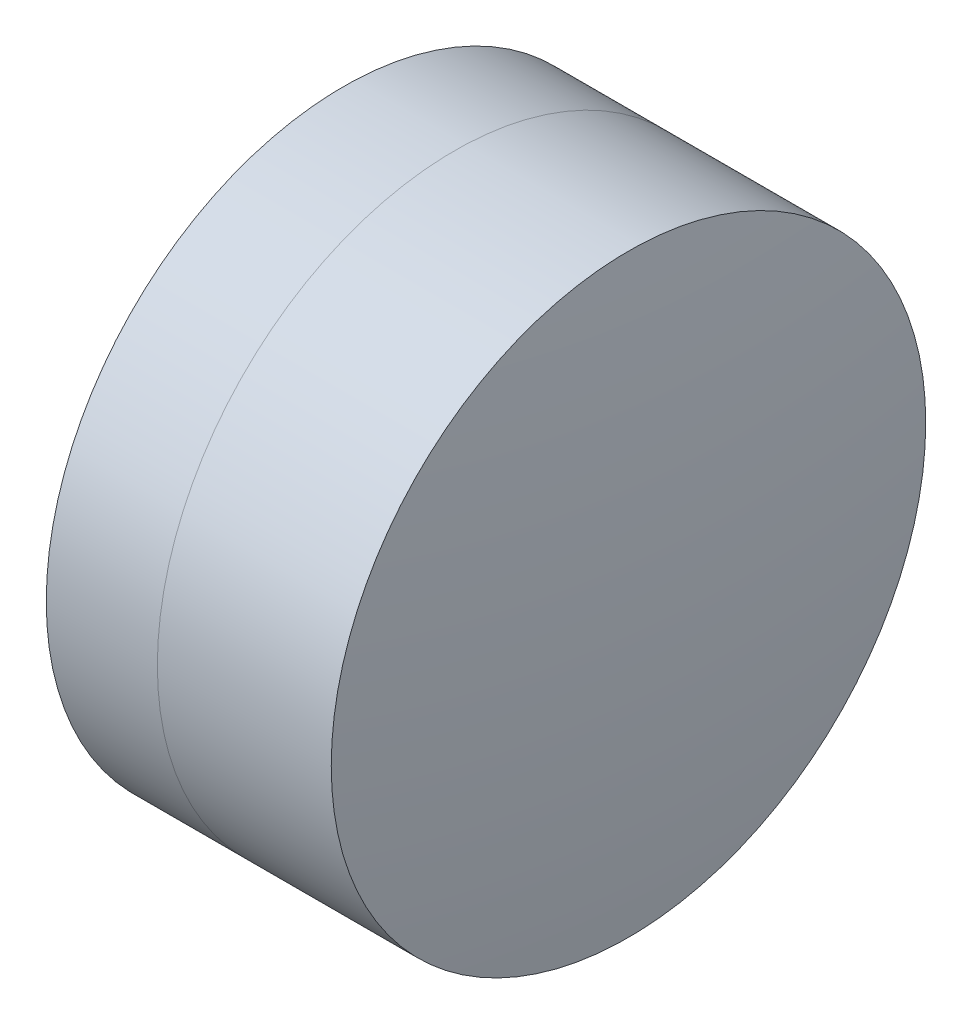
ISO-10303-21;
HEADER;
FILE_DESCRIPTION(('STEP AP214'),'2;1');
FILE_NAME('part.step','',(''),(''),'','','');
FILE_SCHEMA(('AUTOMOTIVE_DESIGN { 1 0 10303 214 1 1 1 1 }'));
ENDSEC;
DATA;
#1=APPLICATION_CONTEXT('core data for automotive mechanical design processes');
#2=APPLICATION_PROTOCOL_DEFINITION('international standard','automotive_design',2000,#1);
#3=PRODUCT_CONTEXT('',#1,'mechanical');
#4=PRODUCT('Part','Part','',(#3));
#5=PRODUCT_RELATED_PRODUCT_CATEGORY('part','',(#4));
#6=PRODUCT_DEFINITION_FORMATION('','',#4);
#7=PRODUCT_DEFINITION_CONTEXT('part definition',#1,'design');
#8=PRODUCT_DEFINITION('design','',#6,#7);
#9=PRODUCT_DEFINITION_SHAPE('','',#8);
#10=(LENGTH_UNIT() NAMED_UNIT(*) SI_UNIT(.MILLI.,.METRE.));
#11=(NAMED_UNIT(*) PLANE_ANGLE_UNIT() SI_UNIT($,.RADIAN.));
#12=(NAMED_UNIT(*) SI_UNIT($,.STERADIAN.) SOLID_ANGLE_UNIT());
#13=UNCERTAINTY_MEASURE_WITH_UNIT(LENGTH_MEASURE(1.E-05),#10,'distance_accuracy_value','');
#14=(GEOMETRIC_REPRESENTATION_CONTEXT(3) GLOBAL_UNCERTAINTY_ASSIGNED_CONTEXT((#13)) GLOBAL_UNIT_ASSIGNED_CONTEXT((#10,
#11,#12)) REPRESENTATION_CONTEXT('',''));
#15=CARTESIAN_POINT('',(0.,0.,0.));
#16=DIRECTION('',(0.,0.,1.));
#17=DIRECTION('',(1.,0.,0.));
#18=AXIS2_PLACEMENT_3D('',#15,#16,#17);
#19=CARTESIAN_POINT('',(-6.63942932123091,0.,0.));
#20=DIRECTION('',(-1.,0.,0.));
#21=DIRECTION('',(0.,0.,1.));
#22=AXIS2_PLACEMENT_3D('',#19,#20,#21);
#23=SPHERICAL_SURFACE('',#22,8.054);
#24=CARTESIAN_POINT('',(-0.325403980768622,0.,0.));
#25=DIRECTION('',(-1.,0.,0.));
#26=DIRECTION('',(0.,0.,1.));
#27=AXIS2_PLACEMENT_3D('',#24,#25,#26);
#28=CIRCLE('',#27,5.);
#29=CARTESIAN_POINT('',(-0.325403980768622,0.,5.));
#30=VERTEX_POINT('',#29);
#31=EDGE_CURVE('E11',#30,#30,#28,.T.);
#32=ORIENTED_EDGE('',*,*,#31,.T.);
#33=EDGE_LOOP('',(#32));
#34=FACE_BOUND('',#33,.T.);
#35=ADVANCED_FACE('F49',(#34),#23,.F.);
#36=CARTESIAN_POINT('',(-0.551919992657797,0.,0.));
#37=DIRECTION('',(-1.,0.,0.));
#38=DIRECTION('',(0.,0.,1.));
#39=AXIS2_PLACEMENT_3D('',#36,#37,#38);
#40=CYLINDRICAL_SURFACE('',#39,5.);
#41=CARTESIAN_POINT('',(2.59933109075285,0.,0.));
#42=DIRECTION('',(-1.,0.,0.));
#43=DIRECTION('',(0.,0.,1.));
#44=AXIS2_PLACEMENT_3D('',#41,#42,#43);
#45=CIRCLE('',#44,5.);
#46=CARTESIAN_POINT('',(2.59933109075285,0.,5.));
#47=VERTEX_POINT('',#46);
#48=EDGE_CURVE('E55',#47,#47,#45,.T.);
#49=ORIENTED_EDGE('',*,*,#48,.T.);
#50=EDGE_LOOP('',(#49));
#51=FACE_BOUND('',#50,.T.);
#52=ORIENTED_EDGE('',*,*,#31,.F.);
#53=EDGE_LOOP('',(#52));
#54=FACE_BOUND('',#53,.T.);
#55=ADVANCED_FACE('F61',(#51,#54),#40,.T.);
#56=CARTESIAN_POINT('',(-36.8954293212309,0.,0.));
#57=DIRECTION('',(-1.,0.,0.));
#58=DIRECTION('',(0.,0.,1.));
#59=AXIS2_PLACEMENT_3D('',#56,#57,#58);
#60=SPHERICAL_SURFACE('',#59,39.81);
#61=ORIENTED_EDGE('',*,*,#48,.F.);
#62=EDGE_LOOP('',(#61));
#63=FACE_BOUND('',#62,.T.);
#64=ADVANCED_FACE('F64',(#63),#60,.T.);
#65=CLOSED_SHELL('',(#35,#55,#64));
#66=MANIFOLD_SOLID_BREP('B2',#65);
#67=CARTESIAN_POINT('',(7.70257067876909,0.,0.));
#68=DIRECTION('',(-1.,0.,0.));
#69=DIRECTION('',(0.,0.,1.));
#70=AXIS2_PLACEMENT_3D('',#67,#68,#69);
#71=SPHERICAL_SURFACE('',#70,11.088);
#72=CARTESIAN_POINT('',(-2.19408249288445,0.,0.));
#73=DIRECTION('',(-1.,0.,0.));
#74=DIRECTION('',(0.,0.,1.));
#75=AXIS2_PLACEMENT_3D('',#72,#73,#74);
#76=CIRCLE('',#75,5.);
#77=CARTESIAN_POINT('',(-2.19408249288445,0.,5.));
#78=VERTEX_POINT('',#77);
#79=EDGE_CURVE('E48',#78,#78,#76,.T.);
#80=ORIENTED_EDGE('',*,*,#79,.T.);
#81=EDGE_LOOP('',(#80));
#82=FACE_BOUND('',#81,.T.);
#83=ADVANCED_FACE('F92',(#82),#71,.T.);
#84=CARTESIAN_POINT('',(-9.70261217833668,0.,0.));
#85=DIRECTION('',(-1.,0.,0.));
#86=DIRECTION('',(0.,0.,1.));
#87=AXIS2_PLACEMENT_3D('',#84,#85,#86);
#88=CYLINDRICAL_SURFACE('',#87,5.);
#89=CARTESIAN_POINT('',(-0.325403980768621,0.,0.));
#90=DIRECTION('',(-1.,0.,0.));
#91=DIRECTION('',(0.,0.,1.));
#92=AXIS2_PLACEMENT_3D('',#89,#90,#91);
#93=CIRCLE('',#92,5.);
#94=CARTESIAN_POINT('',(-0.325403980768621,0.,5.));
#95=VERTEX_POINT('',#94);
#96=EDGE_CURVE('E98',#95,#95,#93,.T.);
#97=ORIENTED_EDGE('',*,*,#96,.T.);
#98=EDGE_LOOP('',(#97));
#99=FACE_BOUND('',#98,.T.);
#100=ORIENTED_EDGE('',*,*,#79,.F.);
#101=EDGE_LOOP('',(#100));
#102=FACE_BOUND('',#101,.T.);
#103=ADVANCED_FACE('F104',(#99,#102),#88,.T.);
#104=CARTESIAN_POINT('',(-6.63942932123091,0.,0.));
#105=DIRECTION('',(-1.,0.,0.));
#106=DIRECTION('',(0.,0.,1.));
#107=AXIS2_PLACEMENT_3D('',#104,#105,#106);
#108=SPHERICAL_SURFACE('',#107,8.054);
#109=ORIENTED_EDGE('',*,*,#96,.F.);
#110=EDGE_LOOP('',(#109));
#111=FACE_BOUND('',#110,.T.);
#112=ADVANCED_FACE('F107',(#111),#108,.T.);
#113=CLOSED_SHELL('',(#83,#103,#112));
#114=MANIFOLD_SOLID_BREP('B6',#113);
#115=ADVANCED_BREP_SHAPE_REPRESENTATION('',(#18,#66,#114),#14);
#116=SHAPE_DEFINITION_REPRESENTATION(#9,#115);
ENDSEC;
END-ISO-10303-21;
